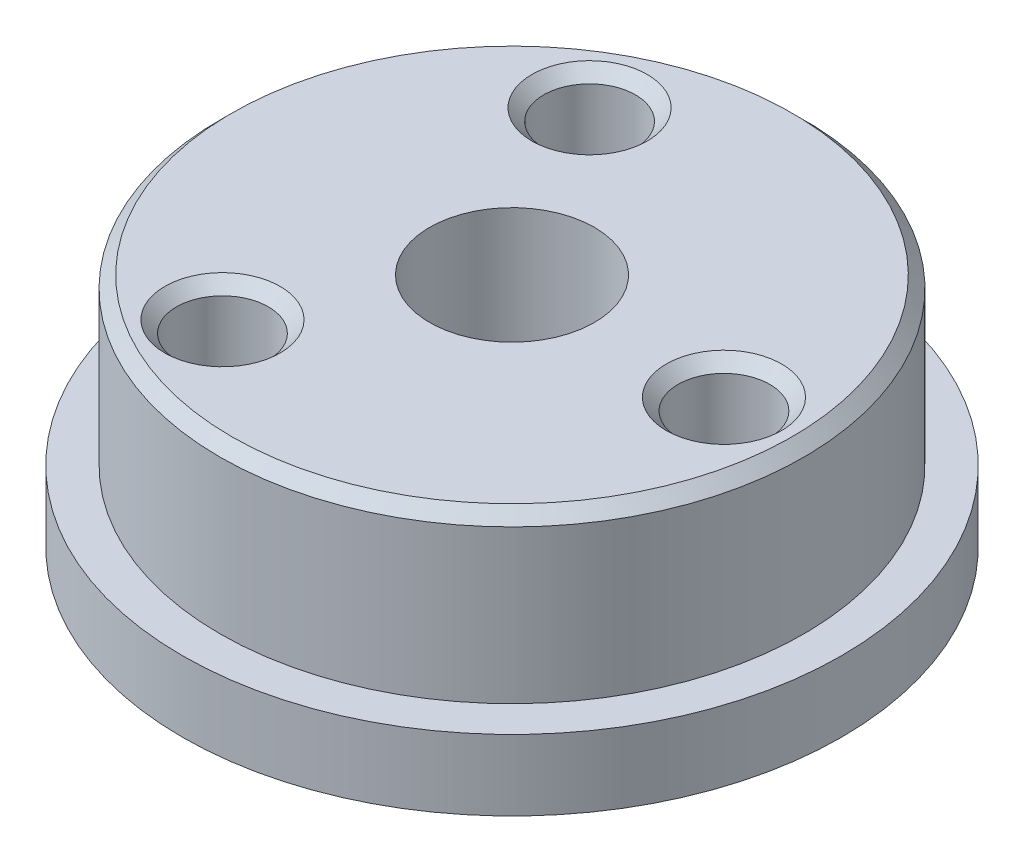
ISO-10303-21;
HEADER;
FILE_DESCRIPTION(('STEP AP214'),'2;1');
FILE_NAME('part.step','',(''),(''),'','','');
FILE_SCHEMA(('AUTOMOTIVE_DESIGN { 1 0 10303 214 1 1 1 1 }'));
ENDSEC;
DATA;
#1=APPLICATION_CONTEXT('core data for automotive mechanical design processes');
#2=APPLICATION_PROTOCOL_DEFINITION('international standard','automotive_design',2000,#1);
#3=PRODUCT_CONTEXT('',#1,'mechanical');
#4=PRODUCT('Part','Part','',(#3));
#5=PRODUCT_RELATED_PRODUCT_CATEGORY('part','',(#4));
#6=PRODUCT_DEFINITION_FORMATION('','',#4);
#7=PRODUCT_DEFINITION_CONTEXT('part definition',#1,'design');
#8=PRODUCT_DEFINITION('design','',#6,#7);
#9=PRODUCT_DEFINITION_SHAPE('','',#8);
#10=(LENGTH_UNIT() NAMED_UNIT(*) SI_UNIT(.MILLI.,.METRE.));
#11=(NAMED_UNIT(*) PLANE_ANGLE_UNIT() SI_UNIT($,.RADIAN.));
#12=(NAMED_UNIT(*) SI_UNIT($,.STERADIAN.) SOLID_ANGLE_UNIT());
#13=UNCERTAINTY_MEASURE_WITH_UNIT(LENGTH_MEASURE(1.E-05),#10,'distance_accuracy_value','');
#14=(GEOMETRIC_REPRESENTATION_CONTEXT(3) GLOBAL_UNCERTAINTY_ASSIGNED_CONTEXT((#13)) GLOBAL_UNIT_ASSIGNED_CONTEXT((#10,
#11,#12)) REPRESENTATION_CONTEXT('',''));
#15=CARTESIAN_POINT('',(0.,0.,0.));
#16=DIRECTION('',(0.,0.,1.));
#17=DIRECTION('',(1.,0.,0.));
#18=AXIS2_PLACEMENT_3D('',#15,#16,#17);
#19=CARTESIAN_POINT('',(0.,3.,0.));
#20=DIRECTION('',(0.,-1.,0.));
#21=DIRECTION('',(0.,0.,-1.));
#22=AXIS2_PLACEMENT_3D('',#19,#20,#21);
#23=CYLINDRICAL_SURFACE('',#22,14.);
#24=CARTESIAN_POINT('',(0.,3.,0.));
#25=DIRECTION('',(0.,1.,0.));
#26=DIRECTION('',(0.,0.,1.));
#27=AXIS2_PLACEMENT_3D('',#24,#25,#26);
#28=CIRCLE('',#27,14.);
#29=CARTESIAN_POINT('',(0.,3.,14.));
#30=VERTEX_POINT('',#29);
#31=EDGE_CURVE('E73',#30,#30,#28,.T.);
#32=ORIENTED_EDGE('',*,*,#31,.F.);
#33=EDGE_LOOP('',(#32));
#34=FACE_BOUND('',#33,.T.);
#35=CARTESIAN_POINT('',(0.,0.,0.));
#36=DIRECTION('',(0.,1.,0.));
#37=DIRECTION('',(0.,0.,1.));
#38=AXIS2_PLACEMENT_3D('',#35,#36,#37);
#39=CIRCLE('',#38,14.);
#40=CARTESIAN_POINT('',(0.,0.,14.));
#41=VERTEX_POINT('',#40);
#42=EDGE_CURVE('E70',#41,#41,#39,.T.);
#43=ORIENTED_EDGE('',*,*,#42,.T.);
#44=EDGE_LOOP('',(#43));
#45=FACE_BOUND('',#44,.T.);
#46=ADVANCED_FACE('F36',(#34,#45),#23,.T.);
#47=CARTESIAN_POINT('',(0.,3.,0.));
#48=DIRECTION('',(0.,1.,0.));
#49=DIRECTION('',(0.,0.,1.));
#50=AXIS2_PLACEMENT_3D('',#47,#48,#49);
#51=PLANE('',#50);
#52=CARTESIAN_POINT('',(0.,3.,0.));
#53=DIRECTION('',(0.,1.,0.));
#54=DIRECTION('',(0.,0.,1.));
#55=AXIS2_PLACEMENT_3D('',#52,#53,#54);
#56=CIRCLE('',#55,12.4);
#57=CARTESIAN_POINT('',(0.,3.,12.4));
#58=VERTEX_POINT('',#57);
#59=EDGE_CURVE('E69',#58,#58,#56,.T.);
#60=ORIENTED_EDGE('',*,*,#59,.F.);
#61=EDGE_LOOP('',(#60));
#62=FACE_BOUND('',#61,.T.);
#63=ORIENTED_EDGE('',*,*,#31,.T.);
#64=EDGE_LOOP('',(#63));
#65=FACE_BOUND('',#64,.T.);
#66=ADVANCED_FACE('F146',(#62,#65),#51,.T.);
#67=CARTESIAN_POINT('',(0.,0.,0.));
#68=DIRECTION('',(0.,1.,0.));
#69=DIRECTION('',(0.,0.,1.));
#70=AXIS2_PLACEMENT_3D('',#67,#68,#69);
#71=PLANE('',#70);
#72=CARTESIAN_POINT('',(0.,0.,0.));
#73=DIRECTION('',(0.,-1.,0.));
#74=DIRECTION('',(0.,0.,-1.));
#75=AXIS2_PLACEMENT_3D('',#72,#73,#74);
#76=CIRCLE('',#75,3.5);
#77=CARTESIAN_POINT('',(0.,0.,-3.5));
#78=VERTEX_POINT('',#77);
#79=EDGE_CURVE('E115',#78,#78,#76,.T.);
#80=ORIENTED_EDGE('',*,*,#79,.F.);
#81=EDGE_LOOP('',(#80));
#82=FACE_BOUND('',#81,.T.);
#83=CARTESIAN_POINT('',(10.5,0.,0.));
#84=DIRECTION('',(0.,-1.,0.));
#85=DIRECTION('',(0.,0.,-1.));
#86=AXIS2_PLACEMENT_3D('',#83,#84,#85);
#87=CIRCLE('',#86,1.65);
#88=CARTESIAN_POINT('',(10.5,0.,-1.65));
#89=VERTEX_POINT('',#88);
#90=EDGE_CURVE('E104',#89,#89,#87,.T.);
#91=ORIENTED_EDGE('',*,*,#90,.F.);
#92=EDGE_LOOP('',(#91));
#93=FACE_BOUND('',#92,.T.);
#94=CARTESIAN_POINT('',(5.25,0.,9.09326673973661));
#95=DIRECTION('',(0.,-1.,0.));
#96=DIRECTION('',(0.,0.,-1.));
#97=AXIS2_PLACEMENT_3D('',#94,#95,#96);
#98=CIRCLE('',#97,1.65);
#99=CARTESIAN_POINT('',(5.25,0.,7.44326673973661));
#100=VERTEX_POINT('',#99);
#101=EDGE_CURVE('E105',#100,#100,#98,.T.);
#102=ORIENTED_EDGE('',*,*,#101,.F.);
#103=EDGE_LOOP('',(#102));
#104=FACE_BOUND('',#103,.T.);
#105=CARTESIAN_POINT('',(-5.25,0.,9.0932667397366));
#106=DIRECTION('',(0.,-1.,0.));
#107=DIRECTION('',(0.,0.,-1.));
#108=AXIS2_PLACEMENT_3D('',#105,#106,#107);
#109=CIRCLE('',#108,1.65);
#110=CARTESIAN_POINT('',(-5.25,0.,7.4432667397366));
#111=VERTEX_POINT('',#110);
#112=EDGE_CURVE('E79',#111,#111,#109,.T.);
#113=ORIENTED_EDGE('',*,*,#112,.F.);
#114=EDGE_LOOP('',(#113));
#115=FACE_BOUND('',#114,.T.);
#116=CARTESIAN_POINT('',(-10.5,0.,0.));
#117=DIRECTION('',(0.,-1.,0.));
#118=DIRECTION('',(0.,0.,-1.));
#119=AXIS2_PLACEMENT_3D('',#116,#117,#118);
#120=CIRCLE('',#119,1.65);
#121=CARTESIAN_POINT('',(-10.5,0.,-1.65));
#122=VERTEX_POINT('',#121);
#123=EDGE_CURVE('E86',#122,#122,#120,.T.);
#124=ORIENTED_EDGE('',*,*,#123,.F.);
#125=EDGE_LOOP('',(#124));
#126=FACE_BOUND('',#125,.T.);
#127=CARTESIAN_POINT('',(-5.25,0.,-9.09326673973661));
#128=DIRECTION('',(0.,-1.,0.));
#129=DIRECTION('',(0.,0.,-1.));
#130=AXIS2_PLACEMENT_3D('',#127,#128,#129);
#131=CIRCLE('',#130,1.65);
#132=CARTESIAN_POINT('',(-5.25,0.,-10.7432667397366));
#133=VERTEX_POINT('',#132);
#134=EDGE_CURVE('E92',#133,#133,#131,.T.);
#135=ORIENTED_EDGE('',*,*,#134,.F.);
#136=EDGE_LOOP('',(#135));
#137=FACE_BOUND('',#136,.T.);
#138=CARTESIAN_POINT('',(5.25,0.,-9.09326673973661));
#139=DIRECTION('',(0.,-1.,0.));
#140=DIRECTION('',(0.,0.,-1.));
#141=AXIS2_PLACEMENT_3D('',#138,#139,#140);
#142=CIRCLE('',#141,1.65);
#143=CARTESIAN_POINT('',(5.25,0.,-10.7432667397366));
#144=VERTEX_POINT('',#143);
#145=EDGE_CURVE('E98',#144,#144,#142,.T.);
#146=ORIENTED_EDGE('',*,*,#145,.F.);
#147=EDGE_LOOP('',(#146));
#148=FACE_BOUND('',#147,.T.);
#149=ORIENTED_EDGE('',*,*,#42,.F.);
#150=EDGE_LOOP('',(#149));
#151=FACE_BOUND('',#150,.T.);
#152=ADVANCED_FACE('F152',(#82,#93,#104,#115,#126,#137,#148,#151),#71,.F.);
#153=CARTESIAN_POINT('',(0.,10.,0.));
#154=DIRECTION('',(0.,-1.,0.));
#155=DIRECTION('',(0.,0.,-1.));
#156=AXIS2_PLACEMENT_3D('',#153,#154,#155);
#157=CYLINDRICAL_SURFACE('',#156,12.4);
#158=CARTESIAN_POINT('',(0.,9.5,0.));
#159=DIRECTION('',(0.,1.,0.));
#160=DIRECTION('',(0.,0.,1.));
#161=AXIS2_PLACEMENT_3D('',#158,#159,#160);
#162=CIRCLE('',#161,12.4);
#163=CARTESIAN_POINT('',(0.,9.5,12.4));
#164=VERTEX_POINT('',#163);
#165=EDGE_CURVE('E52',#164,#164,#162,.F.);
#166=ORIENTED_EDGE('',*,*,#165,.T.);
#167=EDGE_LOOP('',(#166));
#168=FACE_BOUND('',#167,.T.);
#169=ORIENTED_EDGE('',*,*,#59,.T.);
#170=EDGE_LOOP('',(#169));
#171=FACE_BOUND('',#170,.T.);
#172=ADVANCED_FACE('F188',(#168,#171),#157,.T.);
#173=CARTESIAN_POINT('',(0.,10.,0.));
#174=DIRECTION('',(0.,1.,0.));
#175=DIRECTION('',(0.,0.,1.));
#176=AXIS2_PLACEMENT_3D('',#173,#174,#175);
#177=PLANE('',#176);
#178=CARTESIAN_POINT('',(0.,10.,0.));
#179=DIRECTION('',(0.,1.,0.));
#180=DIRECTION('',(0.,0.,1.));
#181=AXIS2_PLACEMENT_3D('',#178,#179,#180);
#182=CIRCLE('',#181,11.9);
#183=CARTESIAN_POINT('',(0.,10.,11.9));
#184=VERTEX_POINT('',#183);
#185=EDGE_CURVE('E57',#184,#184,#182,.T.);
#186=ORIENTED_EDGE('',*,*,#185,.T.);
#187=EDGE_LOOP('',(#186));
#188=FACE_BOUND('',#187,.T.);
#189=CARTESIAN_POINT('',(-4.5,10.,7.79422863405995));
#190=DIRECTION('',(0.,1.,0.));
#191=DIRECTION('',(0.,0.,1.));
#192=AXIS2_PLACEMENT_3D('',#189,#190,#191);
#193=CIRCLE('',#192,2.45);
#194=CARTESIAN_POINT('',(-4.5,10.,10.2442286340599));
#195=VERTEX_POINT('',#194);
#196=EDGE_CURVE('E60',#195,#195,#193,.F.);
#197=ORIENTED_EDGE('',*,*,#196,.T.);
#198=EDGE_LOOP('',(#197));
#199=FACE_BOUND('',#198,.T.);
#200=CARTESIAN_POINT('',(9.,10.,0.));
#201=DIRECTION('',(0.,1.,0.));
#202=DIRECTION('',(0.,0.,1.));
#203=AXIS2_PLACEMENT_3D('',#200,#201,#202);
#204=CIRCLE('',#203,2.45);
#205=CARTESIAN_POINT('',(9.,10.,2.45));
#206=VERTEX_POINT('',#205);
#207=EDGE_CURVE('E63',#206,#206,#204,.F.);
#208=ORIENTED_EDGE('',*,*,#207,.T.);
#209=EDGE_LOOP('',(#208));
#210=FACE_BOUND('',#209,.T.);
#211=CARTESIAN_POINT('',(-4.5,10.,-7.79422863405995));
#212=DIRECTION('',(0.,1.,0.));
#213=DIRECTION('',(0.,0.,1.));
#214=AXIS2_PLACEMENT_3D('',#211,#212,#213);
#215=CIRCLE('',#214,2.45);
#216=CARTESIAN_POINT('',(-4.5,10.,-5.34422863405995));
#217=VERTEX_POINT('',#216);
#218=EDGE_CURVE('E66',#217,#217,#215,.F.);
#219=ORIENTED_EDGE('',*,*,#218,.T.);
#220=EDGE_LOOP('',(#219));
#221=FACE_BOUND('',#220,.T.);
#222=CARTESIAN_POINT('',(0.,10.,0.));
#223=DIRECTION('',(0.,-1.,0.));
#224=DIRECTION('',(0.,0.,-1.));
#225=AXIS2_PLACEMENT_3D('',#222,#223,#224);
#226=CIRCLE('',#225,3.5);
#227=CARTESIAN_POINT('',(0.,10.,-3.5));
#228=VERTEX_POINT('',#227);
#229=EDGE_CURVE('E108',#228,#228,#226,.T.);
#230=ORIENTED_EDGE('',*,*,#229,.T.);
#231=EDGE_LOOP('',(#230));
#232=FACE_BOUND('',#231,.T.);
#233=ADVANCED_FACE('F184',(#188,#199,#210,#221,#232),#177,.T.);
#234=CARTESIAN_POINT('',(5.25,5.1,-9.09326673973661));
#235=DIRECTION('',(0.,-1.,0.));
#236=DIRECTION('',(0.,0.,-1.));
#237=AXIS2_PLACEMENT_3D('',#234,#235,#236);
#238=CYLINDRICAL_SURFACE('',#237,1.65);
#239=CARTESIAN_POINT('',(5.25,5.1,-9.09326673973661));
#240=DIRECTION('',(0.,-1.,0.));
#241=DIRECTION('',(0.,0.,-1.));
#242=AXIS2_PLACEMENT_3D('',#239,#240,#241);
#243=CIRCLE('',#242,1.65);
#244=CARTESIAN_POINT('',(5.25,5.1,-10.7432667397366));
#245=VERTEX_POINT('',#244);
#246=EDGE_CURVE('E101',#245,#245,#243,.T.);
#247=ORIENTED_EDGE('',*,*,#246,.F.);
#248=EDGE_LOOP('',(#247));
#249=FACE_BOUND('',#248,.T.);
#250=ORIENTED_EDGE('',*,*,#145,.T.);
#251=EDGE_LOOP('',(#250));
#252=FACE_BOUND('',#251,.T.);
#253=ADVANCED_FACE('F187',(#249,#252),#238,.F.);
#254=CARTESIAN_POINT('',(5.25,5.1,-9.09326673973661));
#255=DIRECTION('',(0.,-1.,0.));
#256=DIRECTION('',(0.,0.,-1.));
#257=AXIS2_PLACEMENT_3D('',#254,#255,#256);
#258=PLANE('',#257);
#259=ORIENTED_EDGE('',*,*,#246,.T.);
#260=EDGE_LOOP('',(#259));
#261=FACE_BOUND('',#260,.T.);
#262=ADVANCED_FACE('F220',(#261),#258,.T.);
#263=CARTESIAN_POINT('',(-5.25,5.1,-9.09326673973661));
#264=DIRECTION('',(0.,-1.,0.));
#265=DIRECTION('',(0.,0.,-1.));
#266=AXIS2_PLACEMENT_3D('',#263,#264,#265);
#267=CYLINDRICAL_SURFACE('',#266,1.65);
#268=CARTESIAN_POINT('',(-5.25,5.1,-9.09326673973661));
#269=DIRECTION('',(0.,-1.,0.));
#270=DIRECTION('',(0.,0.,-1.));
#271=AXIS2_PLACEMENT_3D('',#268,#269,#270);
#272=CIRCLE('',#271,1.65);
#273=CARTESIAN_POINT('',(-5.25,5.1,-10.7432667397366));
#274=VERTEX_POINT('',#273);
#275=EDGE_CURVE('E95',#274,#274,#272,.T.);
#276=ORIENTED_EDGE('',*,*,#275,.F.);
#277=EDGE_LOOP('',(#276));
#278=FACE_BOUND('',#277,.T.);
#279=ORIENTED_EDGE('',*,*,#134,.T.);
#280=EDGE_LOOP('',(#279));
#281=FACE_BOUND('',#280,.T.);
#282=ADVANCED_FACE('F226',(#278,#281),#267,.F.);
#283=CARTESIAN_POINT('',(-5.25,5.1,-9.09326673973661));
#284=DIRECTION('',(0.,-1.,0.));
#285=DIRECTION('',(0.,0.,-1.));
#286=AXIS2_PLACEMENT_3D('',#283,#284,#285);
#287=PLANE('',#286);
#288=ORIENTED_EDGE('',*,*,#275,.T.);
#289=EDGE_LOOP('',(#288));
#290=FACE_BOUND('',#289,.T.);
#291=ADVANCED_FACE('F232',(#290),#287,.T.);
#292=CARTESIAN_POINT('',(-10.5,5.1,0.));
#293=DIRECTION('',(0.,-1.,0.));
#294=DIRECTION('',(0.,0.,-1.));
#295=AXIS2_PLACEMENT_3D('',#292,#293,#294);
#296=CYLINDRICAL_SURFACE('',#295,1.65);
#297=CARTESIAN_POINT('',(-10.5,5.1,0.));
#298=DIRECTION('',(0.,-1.,0.));
#299=DIRECTION('',(0.,0.,-1.));
#300=AXIS2_PLACEMENT_3D('',#297,#298,#299);
#301=CIRCLE('',#300,1.65);
#302=CARTESIAN_POINT('',(-10.5,5.1,-1.65));
#303=VERTEX_POINT('',#302);
#304=EDGE_CURVE('E89',#303,#303,#301,.T.);
#305=ORIENTED_EDGE('',*,*,#304,.F.);
#306=EDGE_LOOP('',(#305));
#307=FACE_BOUND('',#306,.T.);
#308=ORIENTED_EDGE('',*,*,#123,.T.);
#309=EDGE_LOOP('',(#308));
#310=FACE_BOUND('',#309,.T.);
#311=ADVANCED_FACE('F235',(#307,#310),#296,.F.);
#312=CARTESIAN_POINT('',(-10.5,5.1,0.));
#313=DIRECTION('',(0.,-1.,0.));
#314=DIRECTION('',(0.,0.,-1.));
#315=AXIS2_PLACEMENT_3D('',#312,#313,#314);
#316=PLANE('',#315);
#317=ORIENTED_EDGE('',*,*,#304,.T.);
#318=EDGE_LOOP('',(#317));
#319=FACE_BOUND('',#318,.T.);
#320=ADVANCED_FACE('F240',(#319),#316,.T.);
#321=CARTESIAN_POINT('',(-5.25,5.1,9.0932667397366));
#322=DIRECTION('',(0.,-1.,0.));
#323=DIRECTION('',(0.,0.,-1.));
#324=AXIS2_PLACEMENT_3D('',#321,#322,#323);
#325=CYLINDRICAL_SURFACE('',#324,1.65);
#326=CARTESIAN_POINT('',(-5.25,5.1,9.0932667397366));
#327=DIRECTION('',(0.,-1.,0.));
#328=DIRECTION('',(0.,0.,-1.));
#329=AXIS2_PLACEMENT_3D('',#326,#327,#328);
#330=CIRCLE('',#329,1.65);
#331=CARTESIAN_POINT('',(-5.25,5.1,7.4432667397366));
#332=VERTEX_POINT('',#331);
#333=EDGE_CURVE('E82',#332,#332,#330,.T.);
#334=ORIENTED_EDGE('',*,*,#333,.F.);
#335=EDGE_LOOP('',(#334));
#336=FACE_BOUND('',#335,.T.);
#337=ORIENTED_EDGE('',*,*,#112,.T.);
#338=EDGE_LOOP('',(#337));
#339=FACE_BOUND('',#338,.T.);
#340=ADVANCED_FACE('F243',(#336,#339),#325,.F.);
#341=CARTESIAN_POINT('',(-5.25,5.1,9.0932667397366));
#342=DIRECTION('',(0.,-1.,0.));
#343=DIRECTION('',(0.,0.,-1.));
#344=AXIS2_PLACEMENT_3D('',#341,#342,#343);
#345=PLANE('',#344);
#346=ORIENTED_EDGE('',*,*,#333,.T.);
#347=EDGE_LOOP('',(#346));
#348=FACE_BOUND('',#347,.T.);
#349=ADVANCED_FACE('F248',(#348),#345,.T.);
#350=CARTESIAN_POINT('',(5.25,5.1,9.09326673973661));
#351=DIRECTION('',(0.,-1.,0.));
#352=DIRECTION('',(0.,0.,-1.));
#353=AXIS2_PLACEMENT_3D('',#350,#351,#352);
#354=CYLINDRICAL_SURFACE('',#353,1.65);
#355=CARTESIAN_POINT('',(5.25,5.1,9.09326673973661));
#356=DIRECTION('',(0.,-1.,0.));
#357=DIRECTION('',(0.,0.,-1.));
#358=AXIS2_PLACEMENT_3D('',#355,#356,#357);
#359=CIRCLE('',#358,1.65);
#360=CARTESIAN_POINT('',(5.25,5.1,7.44326673973661));
#361=VERTEX_POINT('',#360);
#362=EDGE_CURVE('E83',#361,#361,#359,.T.);
#363=ORIENTED_EDGE('',*,*,#362,.F.);
#364=EDGE_LOOP('',(#363));
#365=FACE_BOUND('',#364,.T.);
#366=ORIENTED_EDGE('',*,*,#101,.T.);
#367=EDGE_LOOP('',(#366));
#368=FACE_BOUND('',#367,.T.);
#369=ADVANCED_FACE('F251',(#365,#368),#354,.F.);
#370=CARTESIAN_POINT('',(5.25,5.1,9.09326673973661));
#371=DIRECTION('',(0.,-1.,0.));
#372=DIRECTION('',(0.,0.,-1.));
#373=AXIS2_PLACEMENT_3D('',#370,#371,#372);
#374=PLANE('',#373);
#375=ORIENTED_EDGE('',*,*,#362,.T.);
#376=EDGE_LOOP('',(#375));
#377=FACE_BOUND('',#376,.T.);
#378=ADVANCED_FACE('F290',(#377),#374,.T.);
#379=CARTESIAN_POINT('',(10.5,5.1,0.));
#380=DIRECTION('',(0.,-1.,0.));
#381=DIRECTION('',(0.,0.,-1.));
#382=AXIS2_PLACEMENT_3D('',#379,#380,#381);
#383=CYLINDRICAL_SURFACE('',#382,1.65);
#384=CARTESIAN_POINT('',(10.5,5.1,0.));
#385=DIRECTION('',(0.,-1.,0.));
#386=DIRECTION('',(0.,0.,-1.));
#387=AXIS2_PLACEMENT_3D('',#384,#385,#386);
#388=CIRCLE('',#387,1.65);
#389=CARTESIAN_POINT('',(10.5,5.1,-1.65));
#390=VERTEX_POINT('',#389);
#391=EDGE_CURVE('E74',#390,#390,#388,.T.);
#392=ORIENTED_EDGE('',*,*,#391,.F.);
#393=EDGE_LOOP('',(#392));
#394=FACE_BOUND('',#393,.T.);
#395=ORIENTED_EDGE('',*,*,#90,.T.);
#396=EDGE_LOOP('',(#395));
#397=FACE_BOUND('',#396,.T.);
#398=ADVANCED_FACE('F286',(#394,#397),#383,.F.);
#399=CARTESIAN_POINT('',(10.5,5.1,0.));
#400=DIRECTION('',(0.,-1.,0.));
#401=DIRECTION('',(0.,0.,-1.));
#402=AXIS2_PLACEMENT_3D('',#399,#400,#401);
#403=PLANE('',#402);
#404=ORIENTED_EDGE('',*,*,#391,.T.);
#405=EDGE_LOOP('',(#404));
#406=FACE_BOUND('',#405,.T.);
#407=ADVANCED_FACE('F199',(#406),#403,.T.);
#408=CARTESIAN_POINT('',(0.,10.,0.));
#409=DIRECTION('',(0.,-1.,0.));
#410=DIRECTION('',(0.,0.,-1.));
#411=AXIS2_PLACEMENT_3D('',#408,#409,#410);
#412=CYLINDRICAL_SURFACE('',#411,3.5);
#413=ORIENTED_EDGE('',*,*,#229,.F.);
#414=EDGE_LOOP('',(#413));
#415=FACE_BOUND('',#414,.T.);
#416=ORIENTED_EDGE('',*,*,#79,.T.);
#417=EDGE_LOOP('',(#416));
#418=FACE_BOUND('',#417,.T.);
#419=ADVANCED_FACE('F195',(#415,#418),#412,.F.);
#420=CARTESIAN_POINT('',(-4.5,6.8,-7.79422863405995));
#421=DIRECTION('',(0.,1.,0.));
#422=DIRECTION('',(0.,0.,1.));
#423=AXIS2_PLACEMENT_3D('',#420,#421,#422);
#424=CYLINDRICAL_SURFACE('',#423,1.95);
#425=CARTESIAN_POINT('',(-4.5,9.50000000000001,-7.79422863405995));
#426=DIRECTION('',(0.,1.,0.));
#427=DIRECTION('',(0.,0.,1.));
#428=AXIS2_PLACEMENT_3D('',#425,#426,#427);
#429=CIRCLE('',#428,1.95);
#430=CARTESIAN_POINT('',(-4.5,9.50000000000001,-5.84422863405995));
#431=VERTEX_POINT('',#430);
#432=EDGE_CURVE('E10',#431,#431,#429,.T.);
#433=ORIENTED_EDGE('',*,*,#432,.T.);
#434=EDGE_LOOP('',(#433));
#435=FACE_BOUND('',#434,.T.);
#436=CARTESIAN_POINT('',(-4.5,6.8,-7.79422863405995));
#437=DIRECTION('',(0.,1.,0.));
#438=DIRECTION('',(0.,0.,1.));
#439=AXIS2_PLACEMENT_3D('',#436,#437,#438);
#440=CIRCLE('',#439,1.95);
#441=CARTESIAN_POINT('',(-4.5,6.8,-5.84422863405995));
#442=VERTEX_POINT('',#441);
#443=EDGE_CURVE('E121',#442,#442,#440,.T.);
#444=ORIENTED_EDGE('',*,*,#443,.F.);
#445=EDGE_LOOP('',(#444));
#446=FACE_BOUND('',#445,.T.);
#447=ADVANCED_FACE('F198',(#435,#446),#424,.F.);
#448=CARTESIAN_POINT('',(-4.5,6.8,-7.79422863405995));
#449=DIRECTION('',(0.,1.,0.));
#450=DIRECTION('',(0.,0.,1.));
#451=AXIS2_PLACEMENT_3D('',#448,#449,#450);
#452=PLANE('',#451);
#453=ORIENTED_EDGE('',*,*,#443,.T.);
#454=EDGE_LOOP('',(#453));
#455=FACE_BOUND('',#454,.T.);
#456=ADVANCED_FACE('F273',(#455),#452,.T.);
#457=CARTESIAN_POINT('',(-4.5,6.8,7.79422863405995));
#458=DIRECTION('',(0.,1.,0.));
#459=DIRECTION('',(0.,0.,1.));
#460=AXIS2_PLACEMENT_3D('',#457,#458,#459);
#461=CYLINDRICAL_SURFACE('',#460,1.95);
#462=CARTESIAN_POINT('',(-4.5,9.50000000000001,7.79422863405995));
#463=DIRECTION('',(0.,1.,0.));
#464=DIRECTION('',(0.,0.,1.));
#465=AXIS2_PLACEMENT_3D('',#462,#463,#464);
#466=CIRCLE('',#465,1.95);
#467=CARTESIAN_POINT('',(-4.5,9.50000000000001,9.74422863405995));
#468=VERTEX_POINT('',#467);
#469=EDGE_CURVE('E48',#468,#468,#466,.T.);
#470=ORIENTED_EDGE('',*,*,#469,.T.);
#471=EDGE_LOOP('',(#470));
#472=FACE_BOUND('',#471,.T.);
#473=CARTESIAN_POINT('',(-4.5,6.8,7.79422863405995));
#474=DIRECTION('',(0.,1.,0.));
#475=DIRECTION('',(0.,0.,1.));
#476=AXIS2_PLACEMENT_3D('',#473,#474,#475);
#477=CIRCLE('',#476,1.95);
#478=CARTESIAN_POINT('',(-4.5,6.8,9.74422863405995));
#479=VERTEX_POINT('',#478);
#480=EDGE_CURVE('E124',#479,#479,#477,.T.);
#481=ORIENTED_EDGE('',*,*,#480,.F.);
#482=EDGE_LOOP('',(#481));
#483=FACE_BOUND('',#482,.T.);
#484=ADVANCED_FACE('F142',(#472,#483),#461,.F.);
#485=CARTESIAN_POINT('',(-4.5,6.8,7.79422863405995));
#486=DIRECTION('',(0.,1.,0.));
#487=DIRECTION('',(0.,0.,1.));
#488=AXIS2_PLACEMENT_3D('',#485,#486,#487);
#489=PLANE('',#488);
#490=ORIENTED_EDGE('',*,*,#480,.T.);
#491=EDGE_LOOP('',(#490));
#492=FACE_BOUND('',#491,.T.);
#493=ADVANCED_FACE('F134',(#492),#489,.T.);
#494=CARTESIAN_POINT('',(9.,6.8,0.));
#495=DIRECTION('',(0.,1.,0.));
#496=DIRECTION('',(0.,0.,1.));
#497=AXIS2_PLACEMENT_3D('',#494,#495,#496);
#498=CYLINDRICAL_SURFACE('',#497,1.95);
#499=CARTESIAN_POINT('',(9.,9.50000000000001,0.));
#500=DIRECTION('',(0.,1.,0.));
#501=DIRECTION('',(0.,0.,1.));
#502=AXIS2_PLACEMENT_3D('',#499,#500,#501);
#503=CIRCLE('',#502,1.95);
#504=CARTESIAN_POINT('',(9.,9.50000000000001,1.95));
#505=VERTEX_POINT('',#504);
#506=EDGE_CURVE('E44',#505,#505,#503,.T.);
#507=ORIENTED_EDGE('',*,*,#506,.T.);
#508=EDGE_LOOP('',(#507));
#509=FACE_BOUND('',#508,.T.);
#510=CARTESIAN_POINT('',(9.,6.8,0.));
#511=DIRECTION('',(0.,1.,0.));
#512=DIRECTION('',(0.,0.,1.));
#513=AXIS2_PLACEMENT_3D('',#510,#511,#512);
#514=CIRCLE('',#513,1.95);
#515=CARTESIAN_POINT('',(9.,6.8,1.95));
#516=VERTEX_POINT('',#515);
#517=EDGE_CURVE('E118',#516,#516,#514,.T.);
#518=ORIENTED_EDGE('',*,*,#517,.F.);
#519=EDGE_LOOP('',(#518));
#520=FACE_BOUND('',#519,.T.);
#521=ADVANCED_FACE('F132',(#509,#520),#498,.F.);
#522=CARTESIAN_POINT('',(9.,6.8,0.));
#523=DIRECTION('',(0.,1.,0.));
#524=DIRECTION('',(0.,0.,1.));
#525=AXIS2_PLACEMENT_3D('',#522,#523,#524);
#526=PLANE('',#525);
#527=ORIENTED_EDGE('',*,*,#517,.T.);
#528=EDGE_LOOP('',(#527));
#529=FACE_BOUND('',#528,.T.);
#530=ADVANCED_FACE('F130',(#529),#526,.T.);
#531=CARTESIAN_POINT('',(0.,10.,0.));
#532=DIRECTION('',(0.,-1.,0.));
#533=DIRECTION('',(0.,0.,-1.));
#534=AXIS2_PLACEMENT_3D('',#531,#532,#533);
#535=CONICAL_SURFACE('',#534,11.9,0.785398163397452);
#536=ORIENTED_EDGE('',*,*,#165,.F.);
#537=EDGE_LOOP('',(#536));
#538=FACE_BOUND('',#537,.T.);
#539=ORIENTED_EDGE('',*,*,#185,.F.);
#540=EDGE_LOOP('',(#539));
#541=FACE_BOUND('',#540,.T.);
#542=ADVANCED_FACE('F140',(#538,#541),#535,.T.);
#543=CARTESIAN_POINT('',(-4.5,9.50000000000001,7.79422863405995));
#544=DIRECTION('',(0.,1.,0.));
#545=DIRECTION('',(0.,0.,1.));
#546=AXIS2_PLACEMENT_3D('',#543,#544,#545);
#547=CONICAL_SURFACE('',#546,1.95,0.785398163397451);
#548=ORIENTED_EDGE('',*,*,#196,.F.);
#549=EDGE_LOOP('',(#548));
#550=FACE_BOUND('',#549,.T.);
#551=ORIENTED_EDGE('',*,*,#469,.F.);
#552=EDGE_LOOP('',(#551));
#553=FACE_BOUND('',#552,.T.);
#554=ADVANCED_FACE('F165',(#550,#553),#547,.F.);
#555=CARTESIAN_POINT('',(9.,9.50000000000001,0.));
#556=DIRECTION('',(0.,1.,0.));
#557=DIRECTION('',(0.,0.,1.));
#558=AXIS2_PLACEMENT_3D('',#555,#556,#557);
#559=CONICAL_SURFACE('',#558,1.95,0.785398163397451);
#560=ORIENTED_EDGE('',*,*,#207,.F.);
#561=EDGE_LOOP('',(#560));
#562=FACE_BOUND('',#561,.T.);
#563=ORIENTED_EDGE('',*,*,#506,.F.);
#564=EDGE_LOOP('',(#563));
#565=FACE_BOUND('',#564,.T.);
#566=ADVANCED_FACE('F171',(#562,#565),#559,.F.);
#567=CARTESIAN_POINT('',(-4.5,9.50000000000001,-7.79422863405995));
#568=DIRECTION('',(0.,1.,0.));
#569=DIRECTION('',(0.,0.,1.));
#570=AXIS2_PLACEMENT_3D('',#567,#568,#569);
#571=CONICAL_SURFACE('',#570,1.95,0.785398163397452);
#572=ORIENTED_EDGE('',*,*,#218,.F.);
#573=EDGE_LOOP('',(#572));
#574=FACE_BOUND('',#573,.T.);
#575=ORIENTED_EDGE('',*,*,#432,.F.);
#576=EDGE_LOOP('',(#575));
#577=FACE_BOUND('',#576,.T.);
#578=ADVANCED_FACE('F39',(#574,#577),#571,.F.);
#579=CLOSED_SHELL('',(#46,#66,#152,#172,#233,#253,#262,#282,#291,#311,#320,#340,#349,#369,#378,
#398,#407,#419,#447,#456,#484,#493,#521,#530,#542,#554,#566,#578));
#580=MANIFOLD_SOLID_BREP('B2',#579);
#581=ADVANCED_BREP_SHAPE_REPRESENTATION('',(#18,#580),#14);
#582=SHAPE_DEFINITION_REPRESENTATION(#9,#581);
ENDSEC;
END-ISO-10303-21;
